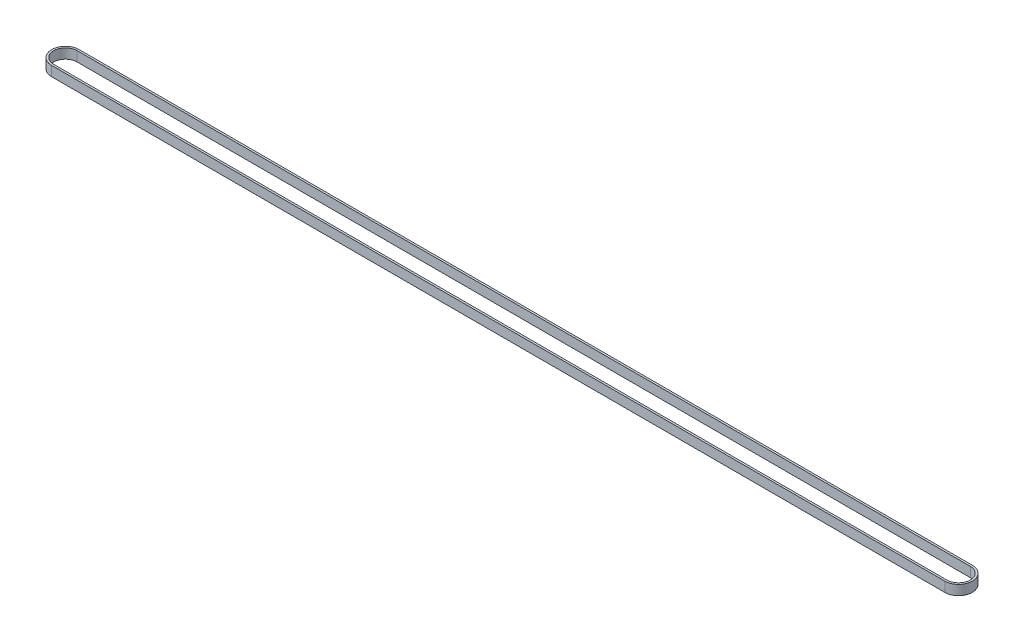
ISO-10303-21;
HEADER;
FILE_DESCRIPTION(('STEP AP214'),'2;1');
FILE_NAME('part.step','',(''),(''),'','','');
FILE_SCHEMA(('AUTOMOTIVE_DESIGN { 1 0 10303 214 1 1 1 1 }'));
ENDSEC;
DATA;
#1=APPLICATION_CONTEXT('core data for automotive mechanical design processes');
#2=APPLICATION_PROTOCOL_DEFINITION('international standard','automotive_design',2000,#1);
#3=PRODUCT_CONTEXT('',#1,'mechanical');
#4=PRODUCT('Part','Part','',(#3));
#5=PRODUCT_RELATED_PRODUCT_CATEGORY('part','',(#4));
#6=PRODUCT_DEFINITION_FORMATION('','',#4);
#7=PRODUCT_DEFINITION_CONTEXT('part definition',#1,'design');
#8=PRODUCT_DEFINITION('design','',#6,#7);
#9=PRODUCT_DEFINITION_SHAPE('','',#8);
#10=(LENGTH_UNIT() NAMED_UNIT(*) SI_UNIT(.MILLI.,.METRE.));
#11=(NAMED_UNIT(*) PLANE_ANGLE_UNIT() SI_UNIT($,.RADIAN.));
#12=(NAMED_UNIT(*) SI_UNIT($,.STERADIAN.) SOLID_ANGLE_UNIT());
#13=UNCERTAINTY_MEASURE_WITH_UNIT(LENGTH_MEASURE(1.E-05),#10,'distance_accuracy_value','');
#14=(GEOMETRIC_REPRESENTATION_CONTEXT(3) GLOBAL_UNCERTAINTY_ASSIGNED_CONTEXT((#13)) GLOBAL_UNIT_ASSIGNED_CONTEXT((#10,
#11,#12)) REPRESENTATION_CONTEXT('',''));
#15=CARTESIAN_POINT('',(0.,0.,0.));
#16=DIRECTION('',(0.,0.,1.));
#17=DIRECTION('',(1.,0.,0.));
#18=AXIS2_PLACEMENT_3D('',#15,#16,#17);
#19=CARTESIAN_POINT('',(0.,-3565.4508695449,0.));
#20=DIRECTION('',(0.,-1.,0.));
#21=DIRECTION('',(0.,0.,-1.));
#22=AXIS2_PLACEMENT_3D('',#19,#20,#21);
#23=PLANE('',#22);
#24=CARTESIAN_POINT('',(0.,-3565.4508695449,0.));
#25=DIRECTION('',(0.,1.,0.));
#26=DIRECTION('',(0.,0.,-1.));
#27=AXIS2_PLACEMENT_3D('',#24,#25,#26);
#28=CIRCLE('',#27,6.99999999999915);
#29=CARTESIAN_POINT('',(0.,-3565.4508695449,7.));
#30=VERTEX_POINT('',#29);
#31=CARTESIAN_POINT('',(0.,-3565.4508695449,-6.9999999999983));
#32=VERTEX_POINT('',#31);
#33=EDGE_CURVE('E134',#30,#32,#28,.T.);
#34=ORIENTED_EDGE('',*,*,#33,.T.);
#35=DIRECTION('',(-1.,0.,0.));
#36=VECTOR('',#35,1.);
#37=CARTESIAN_POINT('',(-454.860000000031,-3565.4508695449,-6.9999999999983));
#38=LINE('',#37,#36);
#39=CARTESIAN_POINT('',(-454.860000000031,-3565.4508695449,-6.9999999999983));
#40=VERTEX_POINT('',#39);
#41=EDGE_CURVE('E137',#32,#40,#38,.T.);
#42=ORIENTED_EDGE('',*,*,#41,.T.);
#43=CARTESIAN_POINT('',(-454.860000000031,-3565.4508695449,9.0726037793587E-13));
#44=DIRECTION('',(0.,1.,0.));
#45=DIRECTION('',(0.,0.,1.));
#46=AXIS2_PLACEMENT_3D('',#43,#44,#45);
#47=CIRCLE('',#46,6.99999999999915);
#48=CARTESIAN_POINT('',(-454.860000000031,-3565.4508695449,7.00000000000006));
#49=VERTEX_POINT('',#48);
#50=EDGE_CURVE('E140',#40,#49,#47,.T.);
#51=ORIENTED_EDGE('',*,*,#50,.T.);
#52=DIRECTION('',(1.,0.,0.));
#53=VECTOR('',#52,1.);
#54=CARTESIAN_POINT('',(-454.860000000031,-3565.4508695449,7.));
#55=LINE('',#54,#53);
#56=EDGE_CURVE('E142',#49,#30,#55,.T.);
#57=ORIENTED_EDGE('',*,*,#56,.T.);
#58=EDGE_LOOP('',(#34,#42,#51,#57));
#59=FACE_BOUND('',#58,.T.);
#60=CARTESIAN_POINT('',(0.,-3565.4508695449,0.));
#61=DIRECTION('',(0.,1.,0.));
#62=DIRECTION('',(0.,0.,-1.));
#63=AXIS2_PLACEMENT_3D('',#60,#61,#62);
#64=CIRCLE('',#63,5.99999999999915);
#65=CARTESIAN_POINT('',(0.,-3565.4508695449,6.));
#66=VERTEX_POINT('',#65);
#67=CARTESIAN_POINT('',(0.,-3565.4508695449,-5.9999999999983));
#68=VERTEX_POINT('',#67);
#69=EDGE_CURVE('E98',#66,#68,#64,.T.);
#70=ORIENTED_EDGE('',*,*,#69,.F.);
#71=DIRECTION('',(1.,0.,0.));
#72=VECTOR('',#71,1.);
#73=CARTESIAN_POINT('',(-454.860000000031,-3565.4508695449,6.));
#74=LINE('',#73,#72);
#75=CARTESIAN_POINT('',(-454.860000000031,-3565.4508695449,6.));
#76=VERTEX_POINT('',#75);
#77=EDGE_CURVE('E120',#76,#66,#74,.T.);
#78=ORIENTED_EDGE('',*,*,#77,.F.);
#79=CARTESIAN_POINT('',(-454.860000000031,-3565.4508695449,9.0726037793587E-13));
#80=DIRECTION('',(0.,1.,0.));
#81=DIRECTION('',(0.,0.,-1.));
#82=AXIS2_PLACEMENT_3D('',#79,#80,#81);
#83=CIRCLE('',#82,5.99999999999915);
#84=CARTESIAN_POINT('',(-454.860000000031,-3565.4508695449,-5.99999999999824));
#85=VERTEX_POINT('',#84);
#86=EDGE_CURVE('E118',#85,#76,#83,.T.);
#87=ORIENTED_EDGE('',*,*,#86,.F.);
#88=DIRECTION('',(-1.,0.,0.));
#89=VECTOR('',#88,1.);
#90=CARTESIAN_POINT('',(-454.860000000031,-3565.4508695449,-5.9999999999983));
#91=LINE('',#90,#89);
#92=EDGE_CURVE('E106',#68,#85,#91,.T.);
#93=ORIENTED_EDGE('',*,*,#92,.F.);
#94=EDGE_LOOP('',(#70,#78,#87,#93));
#95=FACE_BOUND('',#94,.T.);
#96=ADVANCED_FACE('F33',(#59,#95),#23,.F.);
#97=CARTESIAN_POINT('',(0.,-3570.4508695449,0.));
#98=DIRECTION('',(0.,-1.,0.));
#99=DIRECTION('',(0.,0.,-1.));
#100=AXIS2_PLACEMENT_3D('',#97,#98,#99);
#101=PLANE('',#100);
#102=CARTESIAN_POINT('',(0.,-3570.4508695449,0.));
#103=DIRECTION('',(0.,1.,0.));
#104=DIRECTION('',(0.,0.,-1.));
#105=AXIS2_PLACEMENT_3D('',#102,#103,#104);
#106=CIRCLE('',#105,6.99999999999915);
#107=CARTESIAN_POINT('',(0.,-3570.4508695449,7.));
#108=VERTEX_POINT('',#107);
#109=CARTESIAN_POINT('',(0.,-3570.4508695449,-6.9999999999983));
#110=VERTEX_POINT('',#109);
#111=EDGE_CURVE('E114',#108,#110,#106,.T.);
#112=ORIENTED_EDGE('',*,*,#111,.F.);
#113=DIRECTION('',(1.,0.,0.));
#114=VECTOR('',#113,1.);
#115=CARTESIAN_POINT('',(-454.860000000031,-3570.4508695449,7.));
#116=LINE('',#115,#114);
#117=CARTESIAN_POINT('',(-454.860000000031,-3570.4508695449,7.00000000000006));
#118=VERTEX_POINT('',#117);
#119=EDGE_CURVE('E138',#118,#108,#116,.T.);
#120=ORIENTED_EDGE('',*,*,#119,.F.);
#121=CARTESIAN_POINT('',(-454.860000000031,-3570.4508695449,9.0726037793587E-13));
#122=DIRECTION('',(0.,1.,0.));
#123=DIRECTION('',(0.,0.,1.));
#124=AXIS2_PLACEMENT_3D('',#121,#122,#123);
#125=CIRCLE('',#124,6.99999999999915);
#126=CARTESIAN_POINT('',(-454.860000000031,-3570.4508695449,-6.9999999999983));
#127=VERTEX_POINT('',#126);
#128=EDGE_CURVE('E149',#127,#118,#125,.T.);
#129=ORIENTED_EDGE('',*,*,#128,.F.);
#130=DIRECTION('',(-1.,0.,0.));
#131=VECTOR('',#130,1.);
#132=CARTESIAN_POINT('',(-454.860000000031,-3570.4508695449,-6.9999999999983));
#133=LINE('',#132,#131);
#134=EDGE_CURVE('E147',#110,#127,#133,.T.);
#135=ORIENTED_EDGE('',*,*,#134,.F.);
#136=EDGE_LOOP('',(#112,#120,#129,#135));
#137=FACE_BOUND('',#136,.T.);
#138=DIRECTION('',(1.,0.,0.));
#139=VECTOR('',#138,1.);
#140=CARTESIAN_POINT('',(-454.860000000031,-3570.4508695449,6.));
#141=LINE('',#140,#139);
#142=CARTESIAN_POINT('',(-454.860000000031,-3570.4508695449,6.));
#143=VERTEX_POINT('',#142);
#144=CARTESIAN_POINT('',(0.,-3570.4508695449,6.));
#145=VERTEX_POINT('',#144);
#146=EDGE_CURVE('E107',#143,#145,#141,.T.);
#147=ORIENTED_EDGE('',*,*,#146,.T.);
#148=CARTESIAN_POINT('',(0.,-3570.4508695449,0.));
#149=DIRECTION('',(0.,1.,0.));
#150=DIRECTION('',(0.,0.,-1.));
#151=AXIS2_PLACEMENT_3D('',#148,#149,#150);
#152=CIRCLE('',#151,5.99999999999915);
#153=CARTESIAN_POINT('',(0.,-3570.4508695449,-5.9999999999983));
#154=VERTEX_POINT('',#153);
#155=EDGE_CURVE('E56',#145,#154,#152,.T.);
#156=ORIENTED_EDGE('',*,*,#155,.T.);
#157=DIRECTION('',(-1.,0.,0.));
#158=VECTOR('',#157,1.);
#159=CARTESIAN_POINT('',(-454.860000000031,-3570.4508695449,-5.9999999999983));
#160=LINE('',#159,#158);
#161=CARTESIAN_POINT('',(-454.860000000031,-3570.4508695449,-5.99999999999824));
#162=VERTEX_POINT('',#161);
#163=EDGE_CURVE('E113',#154,#162,#160,.T.);
#164=ORIENTED_EDGE('',*,*,#163,.T.);
#165=CARTESIAN_POINT('',(-454.860000000031,-3570.4508695449,9.0726037793587E-13));
#166=DIRECTION('',(0.,1.,0.));
#167=DIRECTION('',(0.,0.,-1.));
#168=AXIS2_PLACEMENT_3D('',#165,#166,#167);
#169=CIRCLE('',#168,5.99999999999915);
#170=EDGE_CURVE('E126',#162,#143,#169,.T.);
#171=ORIENTED_EDGE('',*,*,#170,.T.);
#172=EDGE_LOOP('',(#147,#156,#164,#171));
#173=FACE_BOUND('',#172,.T.);
#174=ADVANCED_FACE('F167',(#137,#173),#101,.T.);
#175=CARTESIAN_POINT('',(0.,-3565.4508695449,0.));
#176=DIRECTION('',(0.,-1.,0.));
#177=DIRECTION('',(0.,0.,-1.));
#178=AXIS2_PLACEMENT_3D('',#175,#176,#177);
#179=CYLINDRICAL_SURFACE('',#178,6.99999999999915);
#180=ORIENTED_EDGE('',*,*,#111,.T.);
#181=DIRECTION('',(0.,-1.,0.));
#182=VECTOR('',#181,1.);
#183=CARTESIAN_POINT('',(0.,-3565.4508695449,-6.9999999999983));
#184=LINE('',#183,#182);
#185=EDGE_CURVE('E11',#32,#110,#184,.T.);
#186=ORIENTED_EDGE('',*,*,#185,.F.);
#187=ORIENTED_EDGE('',*,*,#33,.F.);
#188=DIRECTION('',(0.,-1.,0.));
#189=VECTOR('',#188,1.);
#190=CARTESIAN_POINT('',(0.,-3565.4508695449,7.));
#191=LINE('',#190,#189);
#192=EDGE_CURVE('E144',#30,#108,#191,.T.);
#193=ORIENTED_EDGE('',*,*,#192,.T.);
#194=EDGE_LOOP('',(#180,#186,#187,#193));
#195=FACE_BOUND('',#194,.T.);
#196=ADVANCED_FACE('F35',(#195),#179,.T.);
#197=CARTESIAN_POINT('',(-454.860000000031,-3565.4508695449,-6.9999999999983));
#198=DIRECTION('',(0.,0.,1.));
#199=DIRECTION('',(1.,0.,0.));
#200=AXIS2_PLACEMENT_3D('',#197,#198,#199);
#201=PLANE('',#200);
#202=ORIENTED_EDGE('',*,*,#134,.T.);
#203=DIRECTION('',(0.,-1.,0.));
#204=VECTOR('',#203,1.);
#205=CARTESIAN_POINT('',(-454.860000000031,-3565.4508695449,-6.9999999999983));
#206=LINE('',#205,#204);
#207=EDGE_CURVE('E41',#40,#127,#206,.T.);
#208=ORIENTED_EDGE('',*,*,#207,.F.);
#209=ORIENTED_EDGE('',*,*,#41,.F.);
#210=ORIENTED_EDGE('',*,*,#185,.T.);
#211=EDGE_LOOP('',(#202,#208,#209,#210));
#212=FACE_BOUND('',#211,.T.);
#213=ADVANCED_FACE('F177',(#212),#201,.F.);
#214=CARTESIAN_POINT('',(-454.860000000031,-3565.4508695449,9.0726037793587E-13));
#215=DIRECTION('',(0.,-1.,0.));
#216=DIRECTION('',(0.,0.,-1.));
#217=AXIS2_PLACEMENT_3D('',#214,#215,#216);
#218=CYLINDRICAL_SURFACE('',#217,6.99999999999915);
#219=ORIENTED_EDGE('',*,*,#128,.T.);
#220=DIRECTION('',(0.,-1.,0.));
#221=VECTOR('',#220,1.);
#222=CARTESIAN_POINT('',(-454.860000000031,-3565.4508695449,7.00000000000006));
#223=LINE('',#222,#221);
#224=EDGE_CURVE('E154',#49,#118,#223,.T.);
#225=ORIENTED_EDGE('',*,*,#224,.F.);
#226=ORIENTED_EDGE('',*,*,#50,.F.);
#227=ORIENTED_EDGE('',*,*,#207,.T.);
#228=EDGE_LOOP('',(#219,#225,#226,#227));
#229=FACE_BOUND('',#228,.T.);
#230=ADVANCED_FACE('F161',(#229),#218,.T.);
#231=CARTESIAN_POINT('',(-454.860000000031,-3565.4508695449,7.));
#232=DIRECTION('',(0.,0.,-1.));
#233=DIRECTION('',(-1.,0.,0.));
#234=AXIS2_PLACEMENT_3D('',#231,#232,#233);
#235=PLANE('',#234);
#236=ORIENTED_EDGE('',*,*,#119,.T.);
#237=ORIENTED_EDGE('',*,*,#192,.F.);
#238=ORIENTED_EDGE('',*,*,#56,.F.);
#239=ORIENTED_EDGE('',*,*,#224,.T.);
#240=EDGE_LOOP('',(#236,#237,#238,#239));
#241=FACE_BOUND('',#240,.T.);
#242=ADVANCED_FACE('F171',(#241),#235,.F.);
#243=CARTESIAN_POINT('',(0.,-3565.4508695449,0.));
#244=DIRECTION('',(0.,-1.,0.));
#245=DIRECTION('',(0.,0.,-1.));
#246=AXIS2_PLACEMENT_3D('',#243,#244,#245);
#247=CYLINDRICAL_SURFACE('',#246,5.99999999999915);
#248=ORIENTED_EDGE('',*,*,#155,.F.);
#249=DIRECTION('',(0.,-1.,0.));
#250=VECTOR('',#249,1.);
#251=CARTESIAN_POINT('',(0.,-3565.4508695449,6.));
#252=LINE('',#251,#250);
#253=EDGE_CURVE('E102',#66,#145,#252,.T.);
#254=ORIENTED_EDGE('',*,*,#253,.F.);
#255=ORIENTED_EDGE('',*,*,#69,.T.);
#256=DIRECTION('',(0.,-1.,0.));
#257=VECTOR('',#256,1.);
#258=CARTESIAN_POINT('',(0.,-3565.4508695449,-5.9999999999983));
#259=LINE('',#258,#257);
#260=EDGE_CURVE('E101',#68,#154,#259,.T.);
#261=ORIENTED_EDGE('',*,*,#260,.T.);
#262=EDGE_LOOP('',(#248,#254,#255,#261));
#263=FACE_BOUND('',#262,.T.);
#264=ADVANCED_FACE('F100',(#263),#247,.F.);
#265=CARTESIAN_POINT('',(-454.860000000031,-3565.4508695449,-5.9999999999983));
#266=DIRECTION('',(0.,0.,1.));
#267=DIRECTION('',(1.,0.,0.));
#268=AXIS2_PLACEMENT_3D('',#265,#266,#267);
#269=PLANE('',#268);
#270=ORIENTED_EDGE('',*,*,#163,.F.);
#271=ORIENTED_EDGE('',*,*,#260,.F.);
#272=ORIENTED_EDGE('',*,*,#92,.T.);
#273=DIRECTION('',(0.,-1.,0.));
#274=VECTOR('',#273,1.);
#275=CARTESIAN_POINT('',(-454.860000000031,-3565.4508695449,-5.99999999999824));
#276=LINE('',#275,#274);
#277=EDGE_CURVE('E115',#85,#162,#276,.T.);
#278=ORIENTED_EDGE('',*,*,#277,.T.);
#279=EDGE_LOOP('',(#270,#271,#272,#278));
#280=FACE_BOUND('',#279,.T.);
#281=ADVANCED_FACE('F110',(#280),#269,.T.);
#282=CARTESIAN_POINT('',(-454.860000000031,-3565.4508695449,9.0726037793587E-13));
#283=DIRECTION('',(0.,-1.,0.));
#284=DIRECTION('',(0.,0.,-1.));
#285=AXIS2_PLACEMENT_3D('',#282,#283,#284);
#286=CYLINDRICAL_SURFACE('',#285,5.99999999999915);
#287=ORIENTED_EDGE('',*,*,#170,.F.);
#288=ORIENTED_EDGE('',*,*,#277,.F.);
#289=ORIENTED_EDGE('',*,*,#86,.T.);
#290=DIRECTION('',(0.,-1.,0.));
#291=VECTOR('',#290,1.);
#292=CARTESIAN_POINT('',(-454.860000000031,-3565.4508695449,6.));
#293=LINE('',#292,#291);
#294=EDGE_CURVE('E48',#76,#143,#293,.T.);
#295=ORIENTED_EDGE('',*,*,#294,.T.);
#296=EDGE_LOOP('',(#287,#288,#289,#295));
#297=FACE_BOUND('',#296,.T.);
#298=ADVANCED_FACE('F200',(#297),#286,.F.);
#299=CARTESIAN_POINT('',(-454.860000000031,-3565.4508695449,6.));
#300=DIRECTION('',(0.,0.,-1.));
#301=DIRECTION('',(-1.,0.,0.));
#302=AXIS2_PLACEMENT_3D('',#299,#300,#301);
#303=PLANE('',#302);
#304=ORIENTED_EDGE('',*,*,#146,.F.);
#305=ORIENTED_EDGE('',*,*,#294,.F.);
#306=ORIENTED_EDGE('',*,*,#77,.T.);
#307=ORIENTED_EDGE('',*,*,#253,.T.);
#308=EDGE_LOOP('',(#304,#305,#306,#307));
#309=FACE_BOUND('',#308,.T.);
#310=ADVANCED_FACE('F204',(#309),#303,.T.);
#311=CLOSED_SHELL('',(#96,#174,#196,#213,#230,#242,#264,#281,#298,#310));
#312=MANIFOLD_SOLID_BREP('B2',#311);
#313=ADVANCED_BREP_SHAPE_REPRESENTATION('',(#18,#312),#14);
#314=SHAPE_DEFINITION_REPRESENTATION(#9,#313);
ENDSEC;
END-ISO-10303-21;
